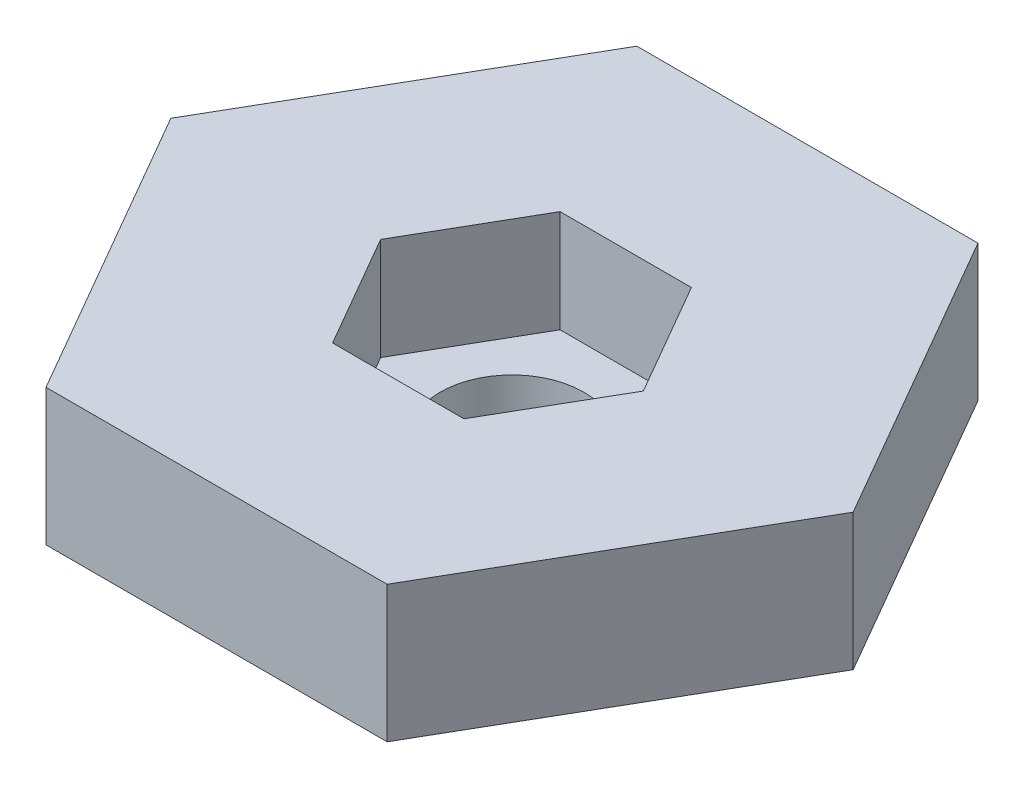
ISO-10303-21;
HEADER;
FILE_DESCRIPTION(('STEP AP214'),'2;1');
FILE_NAME('part.step','',(''),(''),'','','');
FILE_SCHEMA(('AUTOMOTIVE_DESIGN { 1 0 10303 214 1 1 1 1 }'));
ENDSEC;
DATA;
#1=APPLICATION_CONTEXT('core data for automotive mechanical design processes');
#2=APPLICATION_PROTOCOL_DEFINITION('international standard','automotive_design',2000,#1);
#3=PRODUCT_CONTEXT('',#1,'mechanical');
#4=PRODUCT('Part','Part','',(#3));
#5=PRODUCT_RELATED_PRODUCT_CATEGORY('part','',(#4));
#6=PRODUCT_DEFINITION_FORMATION('','',#4);
#7=PRODUCT_DEFINITION_CONTEXT('part definition',#1,'design');
#8=PRODUCT_DEFINITION('design','',#6,#7);
#9=PRODUCT_DEFINITION_SHAPE('','',#8);
#10=(LENGTH_UNIT() NAMED_UNIT(*) SI_UNIT(.MILLI.,.METRE.));
#11=(NAMED_UNIT(*) PLANE_ANGLE_UNIT() SI_UNIT($,.RADIAN.));
#12=(NAMED_UNIT(*) SI_UNIT($,.STERADIAN.) SOLID_ANGLE_UNIT());
#13=UNCERTAINTY_MEASURE_WITH_UNIT(LENGTH_MEASURE(1.E-05),#10,'distance_accuracy_value','');
#14=(GEOMETRIC_REPRESENTATION_CONTEXT(3) GLOBAL_UNCERTAINTY_ASSIGNED_CONTEXT((#13)) GLOBAL_UNIT_ASSIGNED_CONTEXT((#10,
#11,#12)) REPRESENTATION_CONTEXT('',''));
#15=CARTESIAN_POINT('',(0.,0.,0.));
#16=DIRECTION('',(0.,0.,1.));
#17=DIRECTION('',(1.,0.,0.));
#18=AXIS2_PLACEMENT_3D('',#15,#16,#17);
#19=CARTESIAN_POINT('',(0.,6.,0.));
#20=DIRECTION('',(0.,1.,0.));
#21=DIRECTION('',(0.,0.,1.));
#22=AXIS2_PLACEMENT_3D('',#19,#20,#21);
#23=PLANE('',#22);
#24=DIRECTION('',(-1.,0.,0.));
#25=VECTOR('',#24,1.);
#26=CARTESIAN_POINT('',(10.,6.,-17.3205080756888));
#27=LINE('',#26,#25);
#28=CARTESIAN_POINT('',(10.,6.,-17.3205080756888));
#29=VERTEX_POINT('',#28);
#30=CARTESIAN_POINT('',(-10.,6.,-17.3205080756888));
#31=VERTEX_POINT('',#30);
#32=EDGE_CURVE('E208',#29,#31,#27,.T.);
#33=ORIENTED_EDGE('',*,*,#32,.T.);
#34=DIRECTION('',(-0.5,0.,0.866025403784439));
#35=VECTOR('',#34,1.);
#36=CARTESIAN_POINT('',(-10.,6.,-17.3205080756888));
#37=LINE('',#36,#35);
#38=CARTESIAN_POINT('',(-20.,6.,0.));
#39=VERTEX_POINT('',#38);
#40=EDGE_CURVE('E210',#31,#39,#37,.T.);
#41=ORIENTED_EDGE('',*,*,#40,.T.);
#42=DIRECTION('',(0.5,0.,0.866025403784438));
#43=VECTOR('',#42,1.);
#44=CARTESIAN_POINT('',(-20.,6.,0.));
#45=LINE('',#44,#43);
#46=CARTESIAN_POINT('',(-9.99999999999999,6.,17.3205080756888));
#47=VERTEX_POINT('',#46);
#48=EDGE_CURVE('E212',#39,#47,#45,.T.);
#49=ORIENTED_EDGE('',*,*,#48,.T.);
#50=DIRECTION('',(1.,0.,0.));
#51=VECTOR('',#50,1.);
#52=CARTESIAN_POINT('',(-9.99999999999999,6.,17.3205080756888));
#53=LINE('',#52,#51);
#54=CARTESIAN_POINT('',(10.,6.,17.3205080756888));
#55=VERTEX_POINT('',#54);
#56=EDGE_CURVE('E214',#47,#55,#53,.T.);
#57=ORIENTED_EDGE('',*,*,#56,.T.);
#58=DIRECTION('',(0.5,0.,-0.866025403784439));
#59=VECTOR('',#58,1.);
#60=CARTESIAN_POINT('',(10.,6.,17.3205080756888));
#61=LINE('',#60,#59);
#62=CARTESIAN_POINT('',(20.,6.,0.));
#63=VERTEX_POINT('',#62);
#64=EDGE_CURVE('E131',#55,#63,#61,.T.);
#65=ORIENTED_EDGE('',*,*,#64,.T.);
#66=DIRECTION('',(-0.5,0.,-0.866025403784439));
#67=VECTOR('',#66,1.);
#68=CARTESIAN_POINT('',(20.,6.,0.));
#69=LINE('',#68,#67);
#70=EDGE_CURVE('E58',#63,#29,#69,.T.);
#71=ORIENTED_EDGE('',*,*,#70,.T.);
#72=EDGE_LOOP('',(#33,#41,#49,#57,#65,#71));
#73=FACE_BOUND('',#72,.T.);
#74=DIRECTION('',(-0.5,0.,0.866025403784439));
#75=VECTOR('',#74,1.);
#76=CARTESIAN_POINT('',(-3.85,6.,-6.66839560914018));
#77=LINE('',#76,#75);
#78=CARTESIAN_POINT('',(-3.85,6.,-6.66839560914018));
#79=VERTEX_POINT('',#78);
#80=CARTESIAN_POINT('',(-7.7,6.,0.));
#81=VERTEX_POINT('',#80);
#82=EDGE_CURVE('E169',#79,#81,#77,.T.);
#83=ORIENTED_EDGE('',*,*,#82,.F.);
#84=DIRECTION('',(-1.,0.,0.));
#85=VECTOR('',#84,1.);
#86=CARTESIAN_POINT('',(3.85,6.,-6.66839560914018));
#87=LINE('',#86,#85);
#88=CARTESIAN_POINT('',(3.85,6.,-6.66839560914018));
#89=VERTEX_POINT('',#88);
#90=EDGE_CURVE('E167',#89,#79,#87,.T.);
#91=ORIENTED_EDGE('',*,*,#90,.F.);
#92=DIRECTION('',(-0.5,0.,-0.866025403784439));
#93=VECTOR('',#92,1.);
#94=CARTESIAN_POINT('',(7.7,6.,0.));
#95=LINE('',#94,#93);
#96=CARTESIAN_POINT('',(7.7,6.,0.));
#97=VERTEX_POINT('',#96);
#98=EDGE_CURVE('E178',#97,#89,#95,.T.);
#99=ORIENTED_EDGE('',*,*,#98,.F.);
#100=DIRECTION('',(0.5,0.,-0.866025403784439));
#101=VECTOR('',#100,1.);
#102=CARTESIAN_POINT('',(3.85,6.,6.66839560914018));
#103=LINE('',#102,#101);
#104=CARTESIAN_POINT('',(3.85,6.,6.66839560914018));
#105=VERTEX_POINT('',#104);
#106=EDGE_CURVE('E176',#105,#97,#103,.T.);
#107=ORIENTED_EDGE('',*,*,#106,.F.);
#108=DIRECTION('',(1.,0.,0.));
#109=VECTOR('',#108,1.);
#110=CARTESIAN_POINT('',(-3.85,6.,6.66839560914018));
#111=LINE('',#110,#109);
#112=CARTESIAN_POINT('',(-3.85,6.,6.66839560914018));
#113=VERTEX_POINT('',#112);
#114=EDGE_CURVE('E174',#113,#105,#111,.T.);
#115=ORIENTED_EDGE('',*,*,#114,.F.);
#116=DIRECTION('',(0.5,0.,0.866025403784439));
#117=VECTOR('',#116,1.);
#118=CARTESIAN_POINT('',(-7.7,6.,0.));
#119=LINE('',#118,#117);
#120=EDGE_CURVE('E172',#81,#113,#119,.T.);
#121=ORIENTED_EDGE('',*,*,#120,.F.);
#122=EDGE_LOOP('',(#83,#91,#99,#107,#115,#121));
#123=FACE_BOUND('',#122,.T.);
#124=ADVANCED_FACE('F35',(#73,#123),#23,.T.);
#125=CARTESIAN_POINT('',(10.,6.,-17.3205080756888));
#126=DIRECTION('',(0.,0.,1.));
#127=DIRECTION('',(1.,0.,0.));
#128=AXIS2_PLACEMENT_3D('',#125,#126,#127);
#129=PLANE('',#128);
#130=DIRECTION('',(0.,-1.,0.));
#131=VECTOR('',#130,1.);
#132=CARTESIAN_POINT('',(10.,6.,-17.3205080756888));
#133=LINE('',#132,#131);
#134=CARTESIAN_POINT('',(10.,-2.,-17.3205080756888));
#135=VERTEX_POINT('',#134);
#136=EDGE_CURVE('E218',#29,#135,#133,.T.);
#137=ORIENTED_EDGE('',*,*,#136,.T.);
#138=DIRECTION('',(1.,0.,0.));
#139=VECTOR('',#138,1.);
#140=CARTESIAN_POINT('',(10.,-2.,-17.3205080756888));
#141=LINE('',#140,#139);
#142=CARTESIAN_POINT('',(-10.,-2.,-17.3205080756888));
#143=VERTEX_POINT('',#142);
#144=EDGE_CURVE('E163',#143,#135,#141,.T.);
#145=ORIENTED_EDGE('',*,*,#144,.F.);
#146=DIRECTION('',(0.,-1.,0.));
#147=VECTOR('',#146,1.);
#148=CARTESIAN_POINT('',(-10.,6.,-17.3205080756888));
#149=LINE('',#148,#147);
#150=EDGE_CURVE('E11',#31,#143,#149,.T.);
#151=ORIENTED_EDGE('',*,*,#150,.F.);
#152=ORIENTED_EDGE('',*,*,#32,.F.);
#153=EDGE_LOOP('',(#137,#145,#151,#152));
#154=FACE_BOUND('',#153,.T.);
#155=ADVANCED_FACE('F37',(#154),#129,.F.);
#156=CARTESIAN_POINT('',(-10.,6.,-17.3205080756888));
#157=DIRECTION('',(0.866025403784439,0.,0.5));
#158=DIRECTION('',(0.5,0.,-0.866025403784439));
#159=AXIS2_PLACEMENT_3D('',#156,#157,#158);
#160=PLANE('',#159);
#161=ORIENTED_EDGE('',*,*,#150,.T.);
#162=DIRECTION('',(0.5,0.,-0.866025403784439));
#163=VECTOR('',#162,1.);
#164=CARTESIAN_POINT('',(-10.,-2.,-17.3205080756888));
#165=LINE('',#164,#163);
#166=CARTESIAN_POINT('',(-20.,-2.,0.));
#167=VERTEX_POINT('',#166);
#168=EDGE_CURVE('E160',#167,#143,#165,.T.);
#169=ORIENTED_EDGE('',*,*,#168,.F.);
#170=DIRECTION('',(0.,-1.,0.));
#171=VECTOR('',#170,1.);
#172=CARTESIAN_POINT('',(-20.,6.,0.));
#173=LINE('',#172,#171);
#174=EDGE_CURVE('E43',#39,#167,#173,.T.);
#175=ORIENTED_EDGE('',*,*,#174,.F.);
#176=ORIENTED_EDGE('',*,*,#40,.F.);
#177=EDGE_LOOP('',(#161,#169,#175,#176));
#178=FACE_BOUND('',#177,.T.);
#179=ADVANCED_FACE('F228',(#178),#160,.F.);
#180=CARTESIAN_POINT('',(-20.,6.,0.));
#181=DIRECTION('',(0.866025403784439,0.,-0.5));
#182=DIRECTION('',(-0.5,0.,-0.866025403784439));
#183=AXIS2_PLACEMENT_3D('',#180,#181,#182);
#184=PLANE('',#183);
#185=ORIENTED_EDGE('',*,*,#174,.T.);
#186=DIRECTION('',(-0.5,0.,-0.866025403784439));
#187=VECTOR('',#186,1.);
#188=CARTESIAN_POINT('',(-20.,-2.,0.));
#189=LINE('',#188,#187);
#190=CARTESIAN_POINT('',(-9.99999999999999,-2.,17.3205080756888));
#191=VERTEX_POINT('',#190);
#192=EDGE_CURVE('E144',#191,#167,#189,.T.);
#193=ORIENTED_EDGE('',*,*,#192,.F.);
#194=DIRECTION('',(0.,-1.,0.));
#195=VECTOR('',#194,1.);
#196=CARTESIAN_POINT('',(-9.99999999999999,6.,17.3205080756888));
#197=LINE('',#196,#195);
#198=EDGE_CURVE('E134',#47,#191,#197,.T.);
#199=ORIENTED_EDGE('',*,*,#198,.F.);
#200=ORIENTED_EDGE('',*,*,#48,.F.);
#201=EDGE_LOOP('',(#185,#193,#199,#200));
#202=FACE_BOUND('',#201,.T.);
#203=ADVANCED_FACE('F224',(#202),#184,.F.);
#204=CARTESIAN_POINT('',(-9.99999999999999,6.,17.3205080756888));
#205=DIRECTION('',(0.,0.,-1.));
#206=DIRECTION('',(-1.,0.,0.));
#207=AXIS2_PLACEMENT_3D('',#204,#205,#206);
#208=PLANE('',#207);
#209=ORIENTED_EDGE('',*,*,#198,.T.);
#210=DIRECTION('',(-1.,0.,0.));
#211=VECTOR('',#210,1.);
#212=CARTESIAN_POINT('',(-9.99999999999999,-2.,17.3205080756888));
#213=LINE('',#212,#211);
#214=CARTESIAN_POINT('',(10.,-2.,17.3205080756888));
#215=VERTEX_POINT('',#214);
#216=EDGE_CURVE('E138',#215,#191,#213,.T.);
#217=ORIENTED_EDGE('',*,*,#216,.F.);
#218=DIRECTION('',(0.,-1.,0.));
#219=VECTOR('',#218,1.);
#220=CARTESIAN_POINT('',(10.,6.,17.3205080756888));
#221=LINE('',#220,#219);
#222=EDGE_CURVE('E125',#55,#215,#221,.T.);
#223=ORIENTED_EDGE('',*,*,#222,.F.);
#224=ORIENTED_EDGE('',*,*,#56,.F.);
#225=EDGE_LOOP('',(#209,#217,#223,#224));
#226=FACE_BOUND('',#225,.T.);
#227=ADVANCED_FACE('F139',(#226),#208,.F.);
#228=CARTESIAN_POINT('',(10.,6.,17.3205080756888));
#229=DIRECTION('',(-0.866025403784439,0.,-0.5));
#230=DIRECTION('',(-0.5,0.,0.866025403784439));
#231=AXIS2_PLACEMENT_3D('',#228,#229,#230);
#232=PLANE('',#231);
#233=ORIENTED_EDGE('',*,*,#222,.T.);
#234=DIRECTION('',(-0.5,0.,0.866025403784439));
#235=VECTOR('',#234,1.);
#236=CARTESIAN_POINT('',(10.,-2.,17.3205080756888));
#237=LINE('',#236,#235);
#238=CARTESIAN_POINT('',(20.,-2.,0.));
#239=VERTEX_POINT('',#238);
#240=EDGE_CURVE('E130',#239,#215,#237,.T.);
#241=ORIENTED_EDGE('',*,*,#240,.F.);
#242=DIRECTION('',(0.,-1.,0.));
#243=VECTOR('',#242,1.);
#244=CARTESIAN_POINT('',(20.,6.,0.));
#245=LINE('',#244,#243);
#246=EDGE_CURVE('E135',#63,#239,#245,.T.);
#247=ORIENTED_EDGE('',*,*,#246,.F.);
#248=ORIENTED_EDGE('',*,*,#64,.F.);
#249=EDGE_LOOP('',(#233,#241,#247,#248));
#250=FACE_BOUND('',#249,.T.);
#251=ADVANCED_FACE('F127',(#250),#232,.F.);
#252=CARTESIAN_POINT('',(20.,6.,0.));
#253=DIRECTION('',(-0.866025403784438,0.,0.5));
#254=DIRECTION('',(0.5,0.,0.866025403784439));
#255=AXIS2_PLACEMENT_3D('',#252,#253,#254);
#256=PLANE('',#255);
#257=ORIENTED_EDGE('',*,*,#246,.T.);
#258=DIRECTION('',(0.5,0.,0.866025403784439));
#259=VECTOR('',#258,1.);
#260=CARTESIAN_POINT('',(20.,-2.,0.));
#261=LINE('',#260,#259);
#262=EDGE_CURVE('E151',#135,#239,#261,.T.);
#263=ORIENTED_EDGE('',*,*,#262,.F.);
#264=ORIENTED_EDGE('',*,*,#136,.F.);
#265=ORIENTED_EDGE('',*,*,#70,.F.);
#266=EDGE_LOOP('',(#257,#263,#264,#265));
#267=FACE_BOUND('',#266,.T.);
#268=ADVANCED_FACE('F233',(#267),#256,.F.);
#269=CARTESIAN_POINT('',(3.85,6.,-6.66839560914018));
#270=DIRECTION('',(0.,0.,1.));
#271=DIRECTION('',(1.,0.,0.));
#272=AXIS2_PLACEMENT_3D('',#269,#270,#271);
#273=PLANE('',#272);
#274=DIRECTION('',(-1.,0.,0.));
#275=VECTOR('',#274,1.);
#276=CARTESIAN_POINT('',(3.85,0.,-6.66839560914018));
#277=LINE('',#276,#275);
#278=CARTESIAN_POINT('',(3.85,0.,-6.66839560914018));
#279=VERTEX_POINT('',#278);
#280=CARTESIAN_POINT('',(-3.85,0.,-6.66839560914018));
#281=VERTEX_POINT('',#280);
#282=EDGE_CURVE('E166',#279,#281,#277,.T.);
#283=ORIENTED_EDGE('',*,*,#282,.F.);
#284=DIRECTION('',(0.,-1.,0.));
#285=VECTOR('',#284,1.);
#286=CARTESIAN_POINT('',(3.85,6.,-6.66839560914018));
#287=LINE('',#286,#285);
#288=EDGE_CURVE('E180',#89,#279,#287,.T.);
#289=ORIENTED_EDGE('',*,*,#288,.F.);
#290=ORIENTED_EDGE('',*,*,#90,.T.);
#291=DIRECTION('',(0.,-1.,0.));
#292=VECTOR('',#291,1.);
#293=CARTESIAN_POINT('',(-3.85,6.,-6.66839560914018));
#294=LINE('',#293,#292);
#295=EDGE_CURVE('E205',#79,#281,#294,.T.);
#296=ORIENTED_EDGE('',*,*,#295,.T.);
#297=EDGE_LOOP('',(#283,#289,#290,#296));
#298=FACE_BOUND('',#297,.T.);
#299=ADVANCED_FACE('F235',(#298),#273,.T.);
#300=CARTESIAN_POINT('',(-3.85,6.,-6.66839560914018));
#301=DIRECTION('',(0.866025403784439,0.,0.5));
#302=DIRECTION('',(0.5,0.,-0.866025403784439));
#303=AXIS2_PLACEMENT_3D('',#300,#301,#302);
#304=PLANE('',#303);
#305=DIRECTION('',(-0.5,0.,0.866025403784439));
#306=VECTOR('',#305,1.);
#307=CARTESIAN_POINT('',(-3.85,0.,-6.66839560914018));
#308=LINE('',#307,#306);
#309=CARTESIAN_POINT('',(-7.7,0.,0.));
#310=VERTEX_POINT('',#309);
#311=EDGE_CURVE('E183',#281,#310,#308,.T.);
#312=ORIENTED_EDGE('',*,*,#311,.F.);
#313=ORIENTED_EDGE('',*,*,#295,.F.);
#314=ORIENTED_EDGE('',*,*,#82,.T.);
#315=DIRECTION('',(0.,-1.,0.));
#316=VECTOR('',#315,1.);
#317=CARTESIAN_POINT('',(-7.7,6.,0.));
#318=LINE('',#317,#316);
#319=EDGE_CURVE('E203',#81,#310,#318,.T.);
#320=ORIENTED_EDGE('',*,*,#319,.T.);
#321=EDGE_LOOP('',(#312,#313,#314,#320));
#322=FACE_BOUND('',#321,.T.);
#323=ADVANCED_FACE('F242',(#322),#304,.T.);
#324=CARTESIAN_POINT('',(-7.7,6.,0.));
#325=DIRECTION('',(0.866025403784438,0.,-0.5));
#326=DIRECTION('',(-0.5,0.,-0.866025403784439));
#327=AXIS2_PLACEMENT_3D('',#324,#325,#326);
#328=PLANE('',#327);
#329=DIRECTION('',(0.5,0.,0.866025403784439));
#330=VECTOR('',#329,1.);
#331=CARTESIAN_POINT('',(-7.7,0.,0.));
#332=LINE('',#331,#330);
#333=CARTESIAN_POINT('',(-3.85,0.,6.66839560914018));
#334=VERTEX_POINT('',#333);
#335=EDGE_CURVE('E186',#310,#334,#332,.T.);
#336=ORIENTED_EDGE('',*,*,#335,.F.);
#337=ORIENTED_EDGE('',*,*,#319,.F.);
#338=ORIENTED_EDGE('',*,*,#120,.T.);
#339=DIRECTION('',(0.,-1.,0.));
#340=VECTOR('',#339,1.);
#341=CARTESIAN_POINT('',(-3.85,6.,6.66839560914018));
#342=LINE('',#341,#340);
#343=EDGE_CURVE('E201',#113,#334,#342,.T.);
#344=ORIENTED_EDGE('',*,*,#343,.T.);
#345=EDGE_LOOP('',(#336,#337,#338,#344));
#346=FACE_BOUND('',#345,.T.);
#347=ADVANCED_FACE('F256',(#346),#328,.T.);
#348=CARTESIAN_POINT('',(-3.85,6.,6.66839560914018));
#349=DIRECTION('',(0.,0.,-1.));
#350=DIRECTION('',(-1.,0.,0.));
#351=AXIS2_PLACEMENT_3D('',#348,#349,#350);
#352=PLANE('',#351);
#353=DIRECTION('',(1.,0.,0.));
#354=VECTOR('',#353,1.);
#355=CARTESIAN_POINT('',(-3.85,0.,6.66839560914018));
#356=LINE('',#355,#354);
#357=CARTESIAN_POINT('',(3.85,0.,6.66839560914018));
#358=VERTEX_POINT('',#357);
#359=EDGE_CURVE('E189',#334,#358,#356,.T.);
#360=ORIENTED_EDGE('',*,*,#359,.F.);
#361=ORIENTED_EDGE('',*,*,#343,.F.);
#362=ORIENTED_EDGE('',*,*,#114,.T.);
#363=DIRECTION('',(0.,-1.,0.));
#364=VECTOR('',#363,1.);
#365=CARTESIAN_POINT('',(3.85,6.,6.66839560914018));
#366=LINE('',#365,#364);
#367=EDGE_CURVE('E199',#105,#358,#366,.T.);
#368=ORIENTED_EDGE('',*,*,#367,.T.);
#369=EDGE_LOOP('',(#360,#361,#362,#368));
#370=FACE_BOUND('',#369,.T.);
#371=ADVANCED_FACE('F260',(#370),#352,.T.);
#372=CARTESIAN_POINT('',(3.85,6.,6.66839560914018));
#373=DIRECTION('',(-0.866025403784439,0.,-0.5));
#374=DIRECTION('',(-0.5,0.,0.866025403784439));
#375=AXIS2_PLACEMENT_3D('',#372,#373,#374);
#376=PLANE('',#375);
#377=DIRECTION('',(0.5,0.,-0.866025403784439));
#378=VECTOR('',#377,1.);
#379=CARTESIAN_POINT('',(3.85,0.,6.66839560914018));
#380=LINE('',#379,#378);
#381=CARTESIAN_POINT('',(7.7,0.,0.));
#382=VERTEX_POINT('',#381);
#383=EDGE_CURVE('E192',#358,#382,#380,.T.);
#384=ORIENTED_EDGE('',*,*,#383,.F.);
#385=ORIENTED_EDGE('',*,*,#367,.F.);
#386=ORIENTED_EDGE('',*,*,#106,.T.);
#387=DIRECTION('',(0.,-1.,0.));
#388=VECTOR('',#387,1.);
#389=CARTESIAN_POINT('',(7.7,6.,0.));
#390=LINE('',#389,#388);
#391=EDGE_CURVE('E50',#97,#382,#390,.T.);
#392=ORIENTED_EDGE('',*,*,#391,.T.);
#393=EDGE_LOOP('',(#384,#385,#386,#392));
#394=FACE_BOUND('',#393,.T.);
#395=ADVANCED_FACE('F264',(#394),#376,.T.);
#396=CARTESIAN_POINT('',(7.7,6.,0.));
#397=DIRECTION('',(-0.866025403784439,0.,0.5));
#398=DIRECTION('',(0.5,0.,0.866025403784439));
#399=AXIS2_PLACEMENT_3D('',#396,#397,#398);
#400=PLANE('',#399);
#401=DIRECTION('',(-0.5,0.,-0.866025403784439));
#402=VECTOR('',#401,1.);
#403=CARTESIAN_POINT('',(7.7,0.,0.));
#404=LINE('',#403,#402);
#405=EDGE_CURVE('E170',#382,#279,#404,.T.);
#406=ORIENTED_EDGE('',*,*,#405,.F.);
#407=ORIENTED_EDGE('',*,*,#391,.F.);
#408=ORIENTED_EDGE('',*,*,#98,.T.);
#409=ORIENTED_EDGE('',*,*,#288,.T.);
#410=EDGE_LOOP('',(#406,#407,#408,#409));
#411=FACE_BOUND('',#410,.T.);
#412=ADVANCED_FACE('F268',(#411),#400,.T.);
#413=CARTESIAN_POINT('',(0.,-2.,0.));
#414=DIRECTION('',(0.,1.,0.));
#415=DIRECTION('',(0.,0.,1.));
#416=AXIS2_PLACEMENT_3D('',#413,#414,#415);
#417=PLANE('',#416);
#418=ORIENTED_EDGE('',*,*,#240,.T.);
#419=ORIENTED_EDGE('',*,*,#216,.T.);
#420=ORIENTED_EDGE('',*,*,#192,.T.);
#421=ORIENTED_EDGE('',*,*,#168,.T.);
#422=ORIENTED_EDGE('',*,*,#144,.T.);
#423=ORIENTED_EDGE('',*,*,#262,.T.);
#424=EDGE_LOOP('',(#418,#419,#420,#421,#422,#423));
#425=FACE_BOUND('',#424,.T.);
#426=CARTESIAN_POINT('',(0.,-2.,0.));
#427=DIRECTION('',(0.,-1.,0.));
#428=DIRECTION('',(0.,0.,-1.));
#429=AXIS2_PLACEMENT_3D('',#426,#427,#428);
#430=CIRCLE('',#429,4.2);
#431=CARTESIAN_POINT('',(0.,-2.,-4.2));
#432=VERTEX_POINT('',#431);
#433=EDGE_CURVE('E152',#432,#432,#430,.T.);
#434=ORIENTED_EDGE('',*,*,#433,.F.);
#435=EDGE_LOOP('',(#434));
#436=FACE_BOUND('',#435,.T.);
#437=ADVANCED_FACE('F147',(#425,#436),#417,.F.);
#438=CARTESIAN_POINT('',(0.,0.,0.));
#439=DIRECTION('',(0.,1.,0.));
#440=DIRECTION('',(0.,0.,1.));
#441=AXIS2_PLACEMENT_3D('',#438,#439,#440);
#442=PLANE('',#441);
#443=ORIENTED_EDGE('',*,*,#405,.T.);
#444=ORIENTED_EDGE('',*,*,#282,.T.);
#445=ORIENTED_EDGE('',*,*,#311,.T.);
#446=ORIENTED_EDGE('',*,*,#335,.T.);
#447=ORIENTED_EDGE('',*,*,#359,.T.);
#448=ORIENTED_EDGE('',*,*,#383,.T.);
#449=EDGE_LOOP('',(#443,#444,#445,#446,#447,#448));
#450=FACE_BOUND('',#449,.T.);
#451=CARTESIAN_POINT('',(0.,0.,0.));
#452=DIRECTION('',(0.,-1.,0.));
#453=DIRECTION('',(0.,0.,-1.));
#454=AXIS2_PLACEMENT_3D('',#451,#452,#453);
#455=CIRCLE('',#454,4.2);
#456=CARTESIAN_POINT('',(0.,0.,-4.2));
#457=VERTEX_POINT('',#456);
#458=EDGE_CURVE('E155',#457,#457,#455,.T.);
#459=ORIENTED_EDGE('',*,*,#458,.T.);
#460=EDGE_LOOP('',(#459));
#461=FACE_BOUND('',#460,.T.);
#462=ADVANCED_FACE('F272',(#450,#461),#442,.T.);
#463=CARTESIAN_POINT('',(0.,-2.,0.));
#464=DIRECTION('',(0.,1.,0.));
#465=DIRECTION('',(0.,0.,1.));
#466=AXIS2_PLACEMENT_3D('',#463,#464,#465);
#467=CYLINDRICAL_SURFACE('',#466,4.2);
#468=ORIENTED_EDGE('',*,*,#433,.T.);
#469=EDGE_LOOP('',(#468));
#470=FACE_BOUND('',#469,.T.);
#471=ORIENTED_EDGE('',*,*,#458,.F.);
#472=EDGE_LOOP('',(#471));
#473=FACE_BOUND('',#472,.T.);
#474=ADVANCED_FACE('F275',(#470,#473),#467,.F.);
#475=CLOSED_SHELL('',(#124,#155,#179,#203,#227,#251,#268,#299,#323,#347,#371,#395,#412,#437,
#462,#474));
#476=MANIFOLD_SOLID_BREP('B2',#475);
#477=ADVANCED_BREP_SHAPE_REPRESENTATION('',(#18,#476),#14);
#478=SHAPE_DEFINITION_REPRESENTATION(#9,#477);
ENDSEC;
END-ISO-10303-21;
